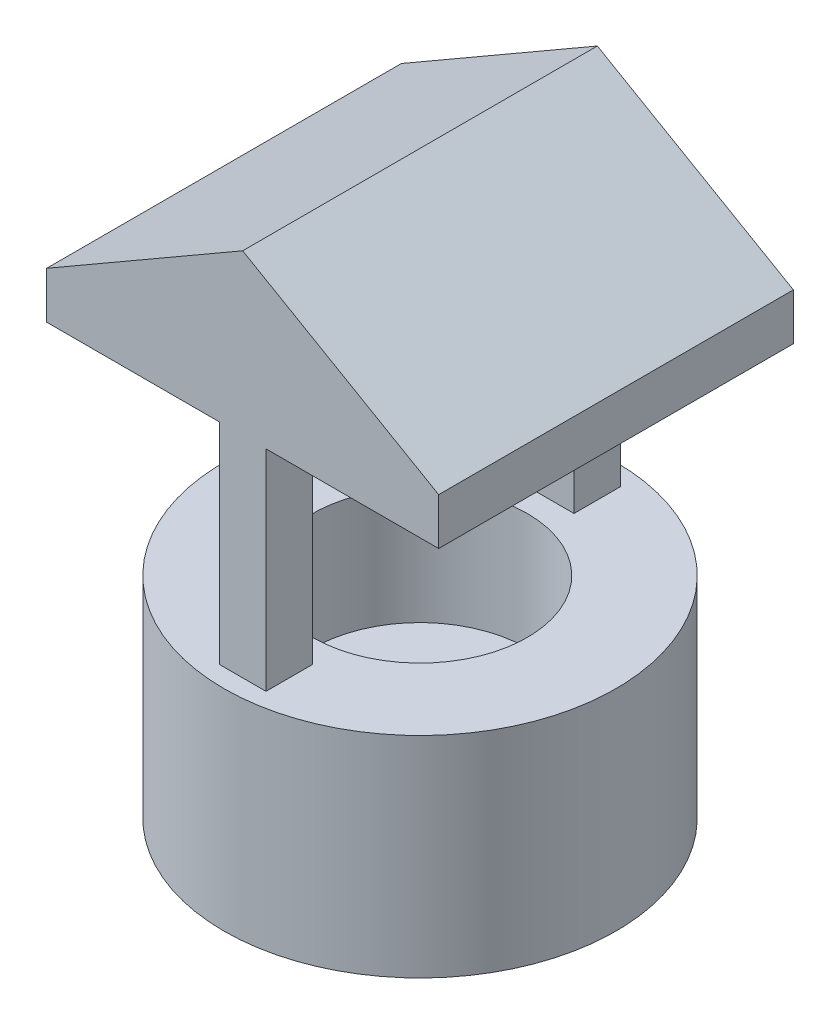
ISO-10303-21;
HEADER;
FILE_DESCRIPTION(('STEP AP214'),'2;1');
FILE_NAME('part.step','',(''),(''),'','','');
FILE_SCHEMA(('AUTOMOTIVE_DESIGN { 1 0 10303 214 1 1 1 1 }'));
ENDSEC;
DATA;
#1=APPLICATION_CONTEXT('core data for automotive mechanical design processes');
#2=APPLICATION_PROTOCOL_DEFINITION('international standard','automotive_design',2000,#1);
#3=PRODUCT_CONTEXT('',#1,'mechanical');
#4=PRODUCT('Part','Part','',(#3));
#5=PRODUCT_RELATED_PRODUCT_CATEGORY('part','',(#4));
#6=PRODUCT_DEFINITION_FORMATION('','',#4);
#7=PRODUCT_DEFINITION_CONTEXT('part definition',#1,'design');
#8=PRODUCT_DEFINITION('design','',#6,#7);
#9=PRODUCT_DEFINITION_SHAPE('','',#8);
#10=(LENGTH_UNIT() NAMED_UNIT(*) SI_UNIT(.MILLI.,.METRE.));
#11=(NAMED_UNIT(*) PLANE_ANGLE_UNIT() SI_UNIT($,.RADIAN.));
#12=(NAMED_UNIT(*) SI_UNIT($,.STERADIAN.) SOLID_ANGLE_UNIT());
#13=UNCERTAINTY_MEASURE_WITH_UNIT(LENGTH_MEASURE(1.E-05),#10,'distance_accuracy_value','');
#14=(GEOMETRIC_REPRESENTATION_CONTEXT(3) GLOBAL_UNCERTAINTY_ASSIGNED_CONTEXT((#13)) GLOBAL_UNIT_ASSIGNED_CONTEXT((#10,
#11,#12)) REPRESENTATION_CONTEXT('',''));
#15=CARTESIAN_POINT('',(0.,0.,0.));
#16=DIRECTION('',(0.,0.,1.));
#17=DIRECTION('',(1.,0.,0.));
#18=AXIS2_PLACEMENT_3D('',#15,#16,#17);
#19=CARTESIAN_POINT('',(0.,45.,0.));
#20=DIRECTION('',(0.,1.,0.));
#21=DIRECTION('',(0.,0.,1.));
#22=AXIS2_PLACEMENT_3D('',#19,#20,#21);
#23=PLANE('',#22);
#24=DIRECTION('',(0.,0.,1.));
#25=VECTOR('',#24,1.);
#26=CARTESIAN_POINT('',(5.00000000000014,45.,-38.));
#27=LINE('',#26,#25);
#28=CARTESIAN_POINT('',(5.00000000000014,45.,-38.));
#29=VERTEX_POINT('',#28);
#30=CARTESIAN_POINT('',(5.00000000000015,45.,-28.));
#31=VERTEX_POINT('',#30);
#32=EDGE_CURVE('E51',#29,#31,#27,.T.);
#33=ORIENTED_EDGE('',*,*,#32,.T.);
#34=DIRECTION('',(-1.,0.,0.));
#35=VECTOR('',#34,1.);
#36=CARTESIAN_POINT('',(5.00000000000015,45.,-28.));
#37=LINE('',#36,#35);
#38=CARTESIAN_POINT('',(-4.99999999999986,45.,-28.));
#39=VERTEX_POINT('',#38);
#40=EDGE_CURVE('E55',#31,#39,#37,.T.);
#41=ORIENTED_EDGE('',*,*,#40,.T.);
#42=DIRECTION('',(0.,0.,-1.));
#43=VECTOR('',#42,1.);
#44=CARTESIAN_POINT('',(-4.99999999999986,45.,-38.));
#45=LINE('',#44,#43);
#46=CARTESIAN_POINT('',(-4.99999999999986,45.,-38.));
#47=VERTEX_POINT('',#46);
#48=EDGE_CURVE('E168',#39,#47,#45,.T.);
#49=ORIENTED_EDGE('',*,*,#48,.T.);
#50=DIRECTION('',(1.,0.,0.));
#51=VECTOR('',#50,1.);
#52=CARTESIAN_POINT('',(5.00000000000014,45.,-38.));
#53=LINE('',#52,#51);
#54=EDGE_CURVE('E169',#47,#29,#53,.T.);
#55=ORIENTED_EDGE('',*,*,#54,.T.);
#56=EDGE_LOOP('',(#33,#41,#49,#55));
#57=FACE_BOUND('',#56,.T.);
#58=CARTESIAN_POINT('',(0.,45.,0.));
#59=DIRECTION('',(0.,1.,0.));
#60=DIRECTION('',(0.,0.,1.));
#61=AXIS2_PLACEMENT_3D('',#58,#59,#60);
#62=CIRCLE('',#61,42.);
#63=CARTESIAN_POINT('',(0.,45.,42.));
#64=VERTEX_POINT('',#63);
#65=EDGE_CURVE('E11',#64,#64,#62,.T.);
#66=ORIENTED_EDGE('',*,*,#65,.T.);
#67=EDGE_LOOP('',(#66));
#68=FACE_BOUND('',#67,.T.);
#69=CARTESIAN_POINT('',(0.,45.,0.));
#70=DIRECTION('',(0.,1.,0.));
#71=DIRECTION('',(0.,0.,1.));
#72=AXIS2_PLACEMENT_3D('',#69,#70,#71);
#73=CIRCLE('',#72,23.);
#74=CARTESIAN_POINT('',(0.,45.,23.));
#75=VERTEX_POINT('',#74);
#76=EDGE_CURVE('E266',#75,#75,#73,.T.);
#77=ORIENTED_EDGE('',*,*,#76,.F.);
#78=EDGE_LOOP('',(#77));
#79=FACE_BOUND('',#78,.T.);
#80=DIRECTION('',(0.,0.,1.));
#81=VECTOR('',#80,1.);
#82=CARTESIAN_POINT('',(-4.99999999999986,45.,38.));
#83=LINE('',#82,#81);
#84=CARTESIAN_POINT('',(-4.99999999999986,45.,28.));
#85=VERTEX_POINT('',#84);
#86=CARTESIAN_POINT('',(-4.99999999999986,45.,38.));
#87=VERTEX_POINT('',#86);
#88=EDGE_CURVE('E252',#85,#87,#83,.T.);
#89=ORIENTED_EDGE('',*,*,#88,.F.);
#90=DIRECTION('',(-1.,0.,0.));
#91=VECTOR('',#90,1.);
#92=CARTESIAN_POINT('',(5.00000000000015,45.,28.));
#93=LINE('',#92,#91);
#94=CARTESIAN_POINT('',(5.00000000000015,45.,28.));
#95=VERTEX_POINT('',#94);
#96=EDGE_CURVE('E248',#95,#85,#93,.T.);
#97=ORIENTED_EDGE('',*,*,#96,.F.);
#98=DIRECTION('',(0.,0.,-1.));
#99=VECTOR('',#98,1.);
#100=CARTESIAN_POINT('',(5.00000000000014,45.,38.));
#101=LINE('',#100,#99);
#102=CARTESIAN_POINT('',(5.00000000000014,45.,38.));
#103=VERTEX_POINT('',#102);
#104=EDGE_CURVE('E268',#103,#95,#101,.T.);
#105=ORIENTED_EDGE('',*,*,#104,.F.);
#106=DIRECTION('',(1.,0.,0.));
#107=VECTOR('',#106,1.);
#108=CARTESIAN_POINT('',(5.00000000000014,45.,38.));
#109=LINE('',#108,#107);
#110=EDGE_CURVE('E259',#87,#103,#109,.T.);
#111=ORIENTED_EDGE('',*,*,#110,.F.);
#112=EDGE_LOOP('',(#89,#97,#105,#111));
#113=FACE_BOUND('',#112,.T.);
#114=ADVANCED_FACE('F33',(#57,#68,#79,#113),#23,.T.);
#115=CARTESIAN_POINT('',(0.,45.,0.));
#116=DIRECTION('',(0.,-1.,0.));
#117=DIRECTION('',(0.,0.,-1.));
#118=AXIS2_PLACEMENT_3D('',#115,#116,#117);
#119=CYLINDRICAL_SURFACE('',#118,42.);
#120=ORIENTED_EDGE('',*,*,#65,.F.);
#121=EDGE_LOOP('',(#120));
#122=FACE_BOUND('',#121,.T.);
#123=CARTESIAN_POINT('',(0.,0.,0.));
#124=DIRECTION('',(0.,1.,0.));
#125=DIRECTION('',(0.,0.,1.));
#126=AXIS2_PLACEMENT_3D('',#123,#124,#125);
#127=CIRCLE('',#126,42.);
#128=CARTESIAN_POINT('',(0.,0.,42.));
#129=VERTEX_POINT('',#128);
#130=EDGE_CURVE('E43',#129,#129,#127,.T.);
#131=ORIENTED_EDGE('',*,*,#130,.T.);
#132=EDGE_LOOP('',(#131));
#133=FACE_BOUND('',#132,.T.);
#134=ADVANCED_FACE('F35',(#122,#133),#119,.T.);
#135=CARTESIAN_POINT('',(0.,0.,0.));
#136=DIRECTION('',(0.,1.,0.));
#137=DIRECTION('',(0.,0.,1.));
#138=AXIS2_PLACEMENT_3D('',#135,#136,#137);
#139=PLANE('',#138);
#140=ORIENTED_EDGE('',*,*,#130,.F.);
#141=EDGE_LOOP('',(#140));
#142=FACE_BOUND('',#141,.T.);
#143=ADVANCED_FACE('F297',(#142),#139,.F.);
#144=CARTESIAN_POINT('',(0.,20.,0.));
#145=DIRECTION('',(0.,1.,0.));
#146=DIRECTION('',(0.,0.,1.));
#147=AXIS2_PLACEMENT_3D('',#144,#145,#146);
#148=CYLINDRICAL_SURFACE('',#147,23.);
#149=CARTESIAN_POINT('',(0.,20.,0.));
#150=DIRECTION('',(0.,1.,0.));
#151=DIRECTION('',(0.,0.,1.));
#152=AXIS2_PLACEMENT_3D('',#149,#150,#151);
#153=CIRCLE('',#152,23.);
#154=CARTESIAN_POINT('',(0.,20.,23.));
#155=VERTEX_POINT('',#154);
#156=EDGE_CURVE('E263',#155,#155,#153,.T.);
#157=ORIENTED_EDGE('',*,*,#156,.F.);
#158=EDGE_LOOP('',(#157));
#159=FACE_BOUND('',#158,.T.);
#160=ORIENTED_EDGE('',*,*,#76,.T.);
#161=EDGE_LOOP('',(#160));
#162=FACE_BOUND('',#161,.T.);
#163=ADVANCED_FACE('F301',(#159,#162),#148,.F.);
#164=CARTESIAN_POINT('',(0.,20.,0.));
#165=DIRECTION('',(0.,1.,0.));
#166=DIRECTION('',(0.,0.,1.));
#167=AXIS2_PLACEMENT_3D('',#164,#165,#166);
#168=PLANE('',#167);
#169=ORIENTED_EDGE('',*,*,#156,.T.);
#170=EDGE_LOOP('',(#169));
#171=FACE_BOUND('',#170,.T.);
#172=ADVANCED_FACE('F308',(#171),#168,.T.);
#173=CARTESIAN_POINT('',(5.00000000000015,30.857864376269,28.));
#174=DIRECTION('',(0.,0.,1.));
#175=DIRECTION('',(1.,0.,0.));
#176=AXIS2_PLACEMENT_3D('',#173,#174,#175);
#177=PLANE('',#176);
#178=DIRECTION('',(0.,1.,0.));
#179=VECTOR('',#178,1.);
#180=CARTESIAN_POINT('',(5.00000000000015,30.857864376269,28.));
#181=LINE('',#180,#179);
#182=CARTESIAN_POINT('',(5.00000000000015,90.,28.));
#183=VERTEX_POINT('',#182);
#184=EDGE_CURVE('E235',#95,#183,#181,.T.);
#185=ORIENTED_EDGE('',*,*,#184,.F.);
#186=ORIENTED_EDGE('',*,*,#96,.T.);
#187=DIRECTION('',(0.,1.,0.));
#188=VECTOR('',#187,1.);
#189=CARTESIAN_POINT('',(-4.99999999999986,30.857864376269,28.));
#190=LINE('',#189,#188);
#191=CARTESIAN_POINT('',(-4.99999999999986,90.,28.));
#192=VERTEX_POINT('',#191);
#193=EDGE_CURVE('E245',#85,#192,#190,.T.);
#194=ORIENTED_EDGE('',*,*,#193,.T.);
#195=DIRECTION('',(1.,0.,0.));
#196=VECTOR('',#195,1.);
#197=CARTESIAN_POINT('',(5.00000000000015,90.,28.));
#198=LINE('',#197,#196);
#199=EDGE_CURVE('E231',#192,#183,#198,.T.);
#200=ORIENTED_EDGE('',*,*,#199,.T.);
#201=EDGE_LOOP('',(#185,#186,#194,#200));
#202=FACE_BOUND('',#201,.T.);
#203=ADVANCED_FACE('F277',(#202),#177,.F.);
#204=CARTESIAN_POINT('',(-4.99999999999986,30.857864376269,38.));
#205=DIRECTION('',(1.,0.,0.));
#206=DIRECTION('',(0.,0.,-1.));
#207=AXIS2_PLACEMENT_3D('',#204,#205,#206);
#208=PLANE('',#207);
#209=ORIENTED_EDGE('',*,*,#193,.F.);
#210=ORIENTED_EDGE('',*,*,#88,.T.);
#211=DIRECTION('',(0.,1.,0.));
#212=VECTOR('',#211,1.);
#213=CARTESIAN_POINT('',(-4.99999999999986,30.857864376269,38.));
#214=LINE('',#213,#212);
#215=CARTESIAN_POINT('',(-4.99999999999989,90.,38.));
#216=VERTEX_POINT('',#215);
#217=EDGE_CURVE('E242',#87,#216,#214,.T.);
#218=ORIENTED_EDGE('',*,*,#217,.T.);
#219=DIRECTION('',(0.,0.,-1.));
#220=VECTOR('',#219,1.);
#221=CARTESIAN_POINT('',(-4.99999999999986,90.,38.));
#222=LINE('',#221,#220);
#223=EDGE_CURVE('E229',#216,#192,#222,.T.);
#224=ORIENTED_EDGE('',*,*,#223,.T.);
#225=EDGE_LOOP('',(#209,#210,#218,#224));
#226=FACE_BOUND('',#225,.T.);
#227=ADVANCED_FACE('F278',(#226),#208,.F.);
#228=CARTESIAN_POINT('',(5.00000000000014,30.857864376269,38.));
#229=DIRECTION('',(0.,0.,-1.));
#230=DIRECTION('',(-1.,0.,0.));
#231=AXIS2_PLACEMENT_3D('',#228,#229,#230);
#232=PLANE('',#231);
#233=ORIENTED_EDGE('',*,*,#217,.F.);
#234=ORIENTED_EDGE('',*,*,#110,.T.);
#235=DIRECTION('',(0.,1.,0.));
#236=VECTOR('',#235,1.);
#237=CARTESIAN_POINT('',(5.00000000000014,30.857864376269,38.));
#238=LINE('',#237,#236);
#239=CARTESIAN_POINT('',(5.00000000000012,90.,38.));
#240=VERTEX_POINT('',#239);
#241=EDGE_CURVE('E244',#103,#240,#238,.T.);
#242=ORIENTED_EDGE('',*,*,#241,.T.);
#243=DIRECTION('',(1.,0.,0.));
#244=VECTOR('',#243,1.);
#245=CARTESIAN_POINT('',(-41.9999999999999,90.,38.));
#246=LINE('',#245,#244);
#247=CARTESIAN_POINT('',(42.0000000000001,90.,38.));
#248=VERTEX_POINT('',#247);
#249=EDGE_CURVE('E177',#240,#248,#246,.T.);
#250=ORIENTED_EDGE('',*,*,#249,.T.);
#251=DIRECTION('',(0.,1.,0.));
#252=VECTOR('',#251,1.);
#253=CARTESIAN_POINT('',(42.0000000000001,90.,38.));
#254=LINE('',#253,#252);
#255=CARTESIAN_POINT('',(42.0000000000001,100.,38.));
#256=VERTEX_POINT('',#255);
#257=EDGE_CURVE('E180',#248,#256,#254,.T.);
#258=ORIENTED_EDGE('',*,*,#257,.T.);
#259=DIRECTION('',(-0.866025403784442,0.499999999999993,0.));
#260=VECTOR('',#259,1.);
#261=CARTESIAN_POINT('',(42.0000000000001,100.,38.));
#262=LINE('',#261,#260);
#263=CARTESIAN_POINT('',(0.,124.248711305964,38.));
#264=VERTEX_POINT('',#263);
#265=EDGE_CURVE('E207',#256,#264,#262,.T.);
#266=ORIENTED_EDGE('',*,*,#265,.T.);
#267=DIRECTION('',(-0.866025403784441,-0.499999999999996,0.));
#268=VECTOR('',#267,1.);
#269=CARTESIAN_POINT('',(0.,124.248711305964,38.));
#270=LINE('',#269,#268);
#271=CARTESIAN_POINT('',(-41.9999999999999,100.,38.));
#272=VERTEX_POINT('',#271);
#273=EDGE_CURVE('E171',#264,#272,#270,.T.);
#274=ORIENTED_EDGE('',*,*,#273,.T.);
#275=DIRECTION('',(0.,-1.,0.));
#276=VECTOR('',#275,1.);
#277=CARTESIAN_POINT('',(-41.9999999999999,100.,38.));
#278=LINE('',#277,#276);
#279=CARTESIAN_POINT('',(-41.9999999999999,90.,38.));
#280=VERTEX_POINT('',#279);
#281=EDGE_CURVE('E174',#272,#280,#278,.T.);
#282=ORIENTED_EDGE('',*,*,#281,.T.);
#283=EDGE_CURVE('E186',#280,#216,#246,.T.);
#284=ORIENTED_EDGE('',*,*,#283,.T.);
#285=EDGE_LOOP('',(#233,#234,#242,#250,#258,#266,#274,#282,#284));
#286=FACE_BOUND('',#285,.T.);
#287=ADVANCED_FACE('F214',(#286),#232,.F.);
#288=CARTESIAN_POINT('',(5.00000000000014,30.857864376269,38.));
#289=DIRECTION('',(-1.,0.,0.));
#290=DIRECTION('',(0.,0.,1.));
#291=AXIS2_PLACEMENT_3D('',#288,#289,#290);
#292=PLANE('',#291);
#293=ORIENTED_EDGE('',*,*,#241,.F.);
#294=ORIENTED_EDGE('',*,*,#104,.T.);
#295=ORIENTED_EDGE('',*,*,#184,.T.);
#296=DIRECTION('',(0.,0.,1.));
#297=VECTOR('',#296,1.);
#298=CARTESIAN_POINT('',(5.00000000000014,90.,38.));
#299=LINE('',#298,#297);
#300=EDGE_CURVE('E37',#183,#240,#299,.T.);
#301=ORIENTED_EDGE('',*,*,#300,.T.);
#302=EDGE_LOOP('',(#293,#294,#295,#301));
#303=FACE_BOUND('',#302,.T.);
#304=ADVANCED_FACE('F281',(#303),#292,.F.);
#305=CARTESIAN_POINT('',(-41.9999999999999,90.,-38.));
#306=DIRECTION('',(0.,-1.,0.));
#307=DIRECTION('',(0.,0.,-1.));
#308=AXIS2_PLACEMENT_3D('',#305,#306,#307);
#309=PLANE('',#308);
#310=DIRECTION('',(0.,0.,-1.));
#311=VECTOR('',#310,1.);
#312=CARTESIAN_POINT('',(5.00000000000014,90.,-38.));
#313=LINE('',#312,#311);
#314=CARTESIAN_POINT('',(5.00000000000014,90.,-28.));
#315=VERTEX_POINT('',#314);
#316=CARTESIAN_POINT('',(5.00000000000014,90.,-38.));
#317=VERTEX_POINT('',#316);
#318=EDGE_CURVE('E146',#315,#317,#313,.T.);
#319=ORIENTED_EDGE('',*,*,#318,.T.);
#320=DIRECTION('',(1.,0.,0.));
#321=VECTOR('',#320,1.);
#322=CARTESIAN_POINT('',(-41.9999999999999,90.,-38.));
#323=LINE('',#322,#321);
#324=CARTESIAN_POINT('',(42.0000000000001,90.,-38.));
#325=VERTEX_POINT('',#324);
#326=EDGE_CURVE('E129',#317,#325,#323,.T.);
#327=ORIENTED_EDGE('',*,*,#326,.T.);
#328=DIRECTION('',(0.,0.,1.));
#329=VECTOR('',#328,1.);
#330=CARTESIAN_POINT('',(42.0000000000001,90.,-38.));
#331=LINE('',#330,#329);
#332=EDGE_CURVE('E194',#325,#248,#331,.T.);
#333=ORIENTED_EDGE('',*,*,#332,.T.);
#334=ORIENTED_EDGE('',*,*,#249,.F.);
#335=ORIENTED_EDGE('',*,*,#300,.F.);
#336=ORIENTED_EDGE('',*,*,#199,.F.);
#337=ORIENTED_EDGE('',*,*,#223,.F.);
#338=ORIENTED_EDGE('',*,*,#283,.F.);
#339=DIRECTION('',(0.,0.,1.));
#340=VECTOR('',#339,1.);
#341=CARTESIAN_POINT('',(-41.9999999999999,90.,-38.));
#342=LINE('',#341,#340);
#343=CARTESIAN_POINT('',(-41.9999999999999,90.,-38.));
#344=VERTEX_POINT('',#343);
#345=EDGE_CURVE('E191',#344,#280,#342,.T.);
#346=ORIENTED_EDGE('',*,*,#345,.F.);
#347=CARTESIAN_POINT('',(-4.99999999999987,90.,-38.));
#348=VERTEX_POINT('',#347);
#349=EDGE_CURVE('E142',#344,#348,#323,.T.);
#350=ORIENTED_EDGE('',*,*,#349,.T.);
#351=DIRECTION('',(0.,0.,1.));
#352=VECTOR('',#351,1.);
#353=CARTESIAN_POINT('',(-4.99999999999986,90.,-38.));
#354=LINE('',#353,#352);
#355=CARTESIAN_POINT('',(-4.99999999999986,90.,-28.));
#356=VERTEX_POINT('',#355);
#357=EDGE_CURVE('E156',#348,#356,#354,.T.);
#358=ORIENTED_EDGE('',*,*,#357,.T.);
#359=DIRECTION('',(1.,0.,0.));
#360=VECTOR('',#359,1.);
#361=CARTESIAN_POINT('',(5.00000000000015,90.,-28.));
#362=LINE('',#361,#360);
#363=EDGE_CURVE('E149',#356,#315,#362,.T.);
#364=ORIENTED_EDGE('',*,*,#363,.T.);
#365=EDGE_LOOP('',(#319,#327,#333,#334,#335,#336,#337,#338,#346,#350,#358,#364));
#366=FACE_BOUND('',#365,.T.);
#367=ADVANCED_FACE('F147',(#366),#309,.T.);
#368=CARTESIAN_POINT('',(0.,124.248711305964,-38.));
#369=DIRECTION('',(-0.499999999999996,0.866025403784441,0.));
#370=DIRECTION('',(-0.866025403784441,-0.499999999999996,0.));
#371=AXIS2_PLACEMENT_3D('',#368,#369,#370);
#372=PLANE('',#371);
#373=DIRECTION('',(0.,0.,1.));
#374=VECTOR('',#373,1.);
#375=CARTESIAN_POINT('',(-41.9999999999999,100.,-38.));
#376=LINE('',#375,#374);
#377=CARTESIAN_POINT('',(-41.9999999999999,100.,-38.));
#378=VERTEX_POINT('',#377);
#379=EDGE_CURVE('E189',#378,#272,#376,.T.);
#380=ORIENTED_EDGE('',*,*,#379,.T.);
#381=ORIENTED_EDGE('',*,*,#273,.F.);
#382=DIRECTION('',(0.,0.,1.));
#383=VECTOR('',#382,1.);
#384=CARTESIAN_POINT('',(0.,124.248711305964,-38.));
#385=LINE('',#384,#383);
#386=CARTESIAN_POINT('',(0.,124.248711305964,-38.));
#387=VERTEX_POINT('',#386);
#388=EDGE_CURVE('E198',#387,#264,#385,.T.);
#389=ORIENTED_EDGE('',*,*,#388,.F.);
#390=DIRECTION('',(-0.866025403784441,-0.499999999999996,0.));
#391=VECTOR('',#390,1.);
#392=CARTESIAN_POINT('',(0.,124.248711305964,-38.));
#393=LINE('',#392,#391);
#394=EDGE_CURVE('E205',#387,#378,#393,.T.);
#395=ORIENTED_EDGE('',*,*,#394,.T.);
#396=EDGE_LOOP('',(#380,#381,#389,#395));
#397=FACE_BOUND('',#396,.T.);
#398=ADVANCED_FACE('F220',(#397),#372,.T.);
#399=CARTESIAN_POINT('',(42.0000000000001,100.,-38.));
#400=DIRECTION('',(0.499999999999993,0.866025403784442,0.));
#401=DIRECTION('',(-0.866025403784442,0.499999999999993,0.));
#402=AXIS2_PLACEMENT_3D('',#399,#400,#401);
#403=PLANE('',#402);
#404=ORIENTED_EDGE('',*,*,#388,.T.);
#405=ORIENTED_EDGE('',*,*,#265,.F.);
#406=DIRECTION('',(0.,0.,1.));
#407=VECTOR('',#406,1.);
#408=CARTESIAN_POINT('',(42.0000000000001,100.,-38.));
#409=LINE('',#408,#407);
#410=CARTESIAN_POINT('',(42.0000000000001,100.,-38.));
#411=VERTEX_POINT('',#410);
#412=EDGE_CURVE('E196',#411,#256,#409,.T.);
#413=ORIENTED_EDGE('',*,*,#412,.F.);
#414=DIRECTION('',(-0.866025403784442,0.499999999999993,0.));
#415=VECTOR('',#414,1.);
#416=CARTESIAN_POINT('',(42.0000000000001,100.,-38.));
#417=LINE('',#416,#415);
#418=EDGE_CURVE('E192',#411,#387,#417,.T.);
#419=ORIENTED_EDGE('',*,*,#418,.T.);
#420=EDGE_LOOP('',(#404,#405,#413,#419));
#421=FACE_BOUND('',#420,.T.);
#422=ADVANCED_FACE('F218',(#421),#403,.T.);
#423=CARTESIAN_POINT('',(42.0000000000001,90.,-38.));
#424=DIRECTION('',(1.,0.,0.));
#425=DIRECTION('',(0.,0.,-1.));
#426=AXIS2_PLACEMENT_3D('',#423,#424,#425);
#427=PLANE('',#426);
#428=ORIENTED_EDGE('',*,*,#412,.T.);
#429=ORIENTED_EDGE('',*,*,#257,.F.);
#430=ORIENTED_EDGE('',*,*,#332,.F.);
#431=DIRECTION('',(0.,1.,0.));
#432=VECTOR('',#431,1.);
#433=CARTESIAN_POINT('',(42.0000000000001,90.,-38.));
#434=LINE('',#433,#432);
#435=EDGE_CURVE('E138',#325,#411,#434,.T.);
#436=ORIENTED_EDGE('',*,*,#435,.T.);
#437=EDGE_LOOP('',(#428,#429,#430,#436));
#438=FACE_BOUND('',#437,.T.);
#439=ADVANCED_FACE('F282',(#438),#427,.T.);
#440=CARTESIAN_POINT('',(-41.9999999999999,100.,-38.));
#441=DIRECTION('',(-1.,0.,0.));
#442=DIRECTION('',(0.,0.,1.));
#443=AXIS2_PLACEMENT_3D('',#440,#441,#442);
#444=PLANE('',#443);
#445=ORIENTED_EDGE('',*,*,#345,.T.);
#446=ORIENTED_EDGE('',*,*,#281,.F.);
#447=ORIENTED_EDGE('',*,*,#379,.F.);
#448=DIRECTION('',(0.,-1.,0.));
#449=VECTOR('',#448,1.);
#450=CARTESIAN_POINT('',(-41.9999999999999,100.,-38.));
#451=LINE('',#450,#449);
#452=EDGE_CURVE('E143',#378,#344,#451,.T.);
#453=ORIENTED_EDGE('',*,*,#452,.T.);
#454=EDGE_LOOP('',(#445,#446,#447,#453));
#455=FACE_BOUND('',#454,.T.);
#456=ADVANCED_FACE('F224',(#455),#444,.T.);
#457=CARTESIAN_POINT('',(0.,0.,-38.));
#458=DIRECTION('',(0.,0.,1.));
#459=DIRECTION('',(1.,0.,0.));
#460=AXIS2_PLACEMENT_3D('',#457,#458,#459);
#461=PLANE('',#460);
#462=ORIENTED_EDGE('',*,*,#394,.F.);
#463=ORIENTED_EDGE('',*,*,#418,.F.);
#464=ORIENTED_EDGE('',*,*,#435,.F.);
#465=ORIENTED_EDGE('',*,*,#326,.F.);
#466=DIRECTION('',(0.,1.,0.));
#467=VECTOR('',#466,1.);
#468=CARTESIAN_POINT('',(5.00000000000014,30.857864376269,-38.));
#469=LINE('',#468,#467);
#470=EDGE_CURVE('E135',#29,#317,#469,.T.);
#471=ORIENTED_EDGE('',*,*,#470,.F.);
#472=ORIENTED_EDGE('',*,*,#54,.F.);
#473=DIRECTION('',(0.,1.,0.));
#474=VECTOR('',#473,1.);
#475=CARTESIAN_POINT('',(-4.99999999999986,30.857864376269,-38.));
#476=LINE('',#475,#474);
#477=EDGE_CURVE('E155',#47,#348,#476,.T.);
#478=ORIENTED_EDGE('',*,*,#477,.T.);
#479=ORIENTED_EDGE('',*,*,#349,.F.);
#480=ORIENTED_EDGE('',*,*,#452,.F.);
#481=EDGE_LOOP('',(#462,#463,#464,#465,#471,#472,#478,#479,#480));
#482=FACE_BOUND('',#481,.T.);
#483=ADVANCED_FACE('F132',(#482),#461,.F.);
#484=CARTESIAN_POINT('',(5.00000000000014,30.857864376269,-38.));
#485=DIRECTION('',(1.,0.,0.));
#486=DIRECTION('',(0.,0.,-1.));
#487=AXIS2_PLACEMENT_3D('',#484,#485,#486);
#488=PLANE('',#487);
#489=ORIENTED_EDGE('',*,*,#32,.F.);
#490=ORIENTED_EDGE('',*,*,#470,.T.);
#491=ORIENTED_EDGE('',*,*,#318,.F.);
#492=DIRECTION('',(0.,1.,0.));
#493=VECTOR('',#492,1.);
#494=CARTESIAN_POINT('',(5.00000000000015,30.857864376269,-28.));
#495=LINE('',#494,#493);
#496=EDGE_CURVE('E166',#31,#315,#495,.T.);
#497=ORIENTED_EDGE('',*,*,#496,.F.);
#498=EDGE_LOOP('',(#489,#490,#491,#497));
#499=FACE_BOUND('',#498,.T.);
#500=ADVANCED_FACE('F154',(#499),#488,.T.);
#501=CARTESIAN_POINT('',(5.00000000000015,30.857864376269,-28.));
#502=DIRECTION('',(0.,0.,1.));
#503=DIRECTION('',(1.,0.,0.));
#504=AXIS2_PLACEMENT_3D('',#501,#502,#503);
#505=PLANE('',#504);
#506=ORIENTED_EDGE('',*,*,#40,.F.);
#507=ORIENTED_EDGE('',*,*,#496,.T.);
#508=ORIENTED_EDGE('',*,*,#363,.F.);
#509=DIRECTION('',(0.,1.,0.));
#510=VECTOR('',#509,1.);
#511=CARTESIAN_POINT('',(-4.99999999999986,30.857864376269,-28.));
#512=LINE('',#511,#510);
#513=EDGE_CURVE('E159',#39,#356,#512,.T.);
#514=ORIENTED_EDGE('',*,*,#513,.F.);
#515=EDGE_LOOP('',(#506,#507,#508,#514));
#516=FACE_BOUND('',#515,.T.);
#517=ADVANCED_FACE('F422',(#516),#505,.T.);
#518=CARTESIAN_POINT('',(-4.99999999999986,30.857864376269,-38.));
#519=DIRECTION('',(-1.,0.,0.));
#520=DIRECTION('',(0.,0.,1.));
#521=AXIS2_PLACEMENT_3D('',#518,#519,#520);
#522=PLANE('',#521);
#523=ORIENTED_EDGE('',*,*,#48,.F.);
#524=ORIENTED_EDGE('',*,*,#513,.T.);
#525=ORIENTED_EDGE('',*,*,#357,.F.);
#526=ORIENTED_EDGE('',*,*,#477,.F.);
#527=EDGE_LOOP('',(#523,#524,#525,#526));
#528=FACE_BOUND('',#527,.T.);
#529=ADVANCED_FACE('F430',(#528),#522,.T.);
#530=CLOSED_SHELL('',(#114,#134,#143,#163,#172,#203,#227,#287,#304,#367,#398,#422,#439,#456,
#483,#500,#517,#529));
#531=MANIFOLD_SOLID_BREP('B2',#530);
#532=ADVANCED_BREP_SHAPE_REPRESENTATION('',(#18,#531),#14);
#533=SHAPE_DEFINITION_REPRESENTATION(#9,#532);
ENDSEC;
END-ISO-10303-21;
